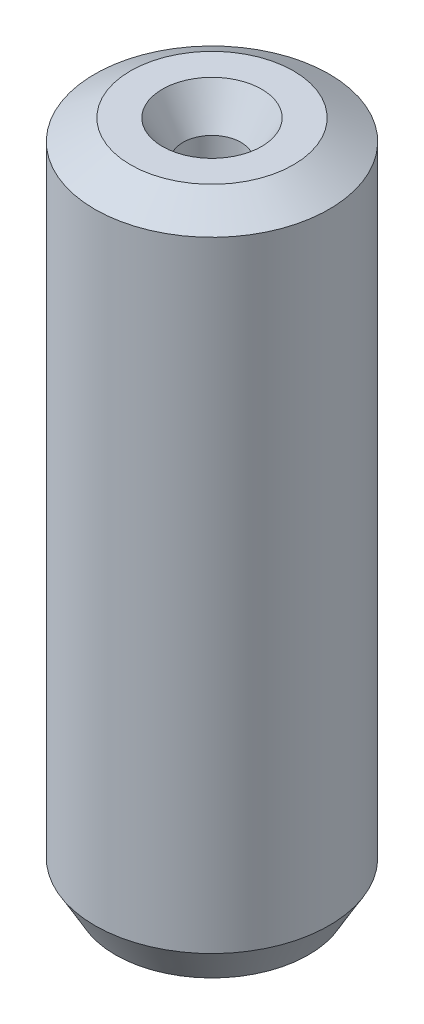
ISO-10303-21;
HEADER;
FILE_DESCRIPTION(('STEP AP214'),'2;1');
FILE_NAME('part.step','',(''),(''),'','','');
FILE_SCHEMA(('AUTOMOTIVE_DESIGN { 1 0 10303 214 1 1 1 1 }'));
ENDSEC;
DATA;
#1=APPLICATION_CONTEXT('core data for automotive mechanical design processes');
#2=APPLICATION_PROTOCOL_DEFINITION('international standard','automotive_design',2000,#1);
#3=PRODUCT_CONTEXT('',#1,'mechanical');
#4=PRODUCT('Part','Part','',(#3));
#5=PRODUCT_RELATED_PRODUCT_CATEGORY('part','',(#4));
#6=PRODUCT_DEFINITION_FORMATION('','',#4);
#7=PRODUCT_DEFINITION_CONTEXT('part definition',#1,'design');
#8=PRODUCT_DEFINITION('design','',#6,#7);
#9=PRODUCT_DEFINITION_SHAPE('','',#8);
#10=(LENGTH_UNIT() NAMED_UNIT(*) SI_UNIT(.MILLI.,.METRE.));
#11=(NAMED_UNIT(*) PLANE_ANGLE_UNIT() SI_UNIT($,.RADIAN.));
#12=(NAMED_UNIT(*) SI_UNIT($,.STERADIAN.) SOLID_ANGLE_UNIT());
#13=UNCERTAINTY_MEASURE_WITH_UNIT(LENGTH_MEASURE(1.E-05),#10,'distance_accuracy_value','');
#14=(GEOMETRIC_REPRESENTATION_CONTEXT(3) GLOBAL_UNCERTAINTY_ASSIGNED_CONTEXT((#13)) GLOBAL_UNIT_ASSIGNED_CONTEXT((#10,
#11,#12)) REPRESENTATION_CONTEXT('',''));
#15=CARTESIAN_POINT('',(0.,0.,0.));
#16=DIRECTION('',(0.,0.,1.));
#17=DIRECTION('',(1.,0.,0.));
#18=AXIS2_PLACEMENT_3D('',#15,#16,#17);
#19=CARTESIAN_POINT('',(0.,28.8736243650082,0.));
#20=DIRECTION('',(0.,-1.,0.));
#21=DIRECTION('',(0.,0.,-1.));
#22=AXIS2_PLACEMENT_3D('',#19,#20,#21);
#23=CYLINDRICAL_SURFACE('',#22,5.);
#24=CARTESIAN_POINT('',(0.,1.52475165972592,0.));
#25=DIRECTION('',(0.,1.,0.));
#26=DIRECTION('',(0.,0.,1.));
#27=AXIS2_PLACEMENT_3D('',#24,#25,#26);
#28=CIRCLE('',#27,5.);
#29=CARTESIAN_POINT('',(0.,1.52475165972592,-5.));
#30=VERTEX_POINT('',#29);
#31=EDGE_CURVE('E10',#30,#30,#28,.T.);
#32=CARTESIAN_POINT('',(0.,27.9933085838182,0.));
#33=DIRECTION('',(0.,1.,0.));
#34=DIRECTION('',(0.,0.,1.));
#35=AXIS2_PLACEMENT_3D('',#32,#33,#34);
#36=CIRCLE('',#35,5.);
#37=CARTESIAN_POINT('',(0.,27.9933085838182,-5.));
#38=VERTEX_POINT('',#37);
#39=EDGE_CURVE('E50',#38,#38,#36,.F.);
#40=CARTESIAN_POINT('',(0.,1.52475165972592,-5.));
#41=CARTESIAN_POINT('',(0.,1.80046579435188,-5.));
#42=CARTESIAN_POINT('',(0.,2.07617992897784,-5.));
#43=CARTESIAN_POINT('',(0.,2.62760819822976,-5.));
#44=CARTESIAN_POINT('',(0.,2.90332233285572,-5.));
#45=CARTESIAN_POINT('',(0.,3.45475060210765,-5.));
#46=CARTESIAN_POINT('',(0.,3.73046473673361,-5.));
#47=CARTESIAN_POINT('',(0.,4.28189300598553,-5.));
#48=CARTESIAN_POINT('',(0.,4.55760714061149,-5.));
#49=CARTESIAN_POINT('',(0.,5.10903540986341,-5.));
#50=CARTESIAN_POINT('',(0.,5.38474954448937,-5.));
#51=CARTESIAN_POINT('',(0.,5.93617781374129,-5.));
#52=CARTESIAN_POINT('',(0.,6.21189194836726,-5.));
#53=CARTESIAN_POINT('',(0.,6.76332021761918,-5.));
#54=CARTESIAN_POINT('',(0.,7.03903435224514,-5.));
#55=CARTESIAN_POINT('',(0.,7.59046262149706,-5.));
#56=CARTESIAN_POINT('',(0.,7.86617675612302,-5.));
#57=CARTESIAN_POINT('',(0.,8.41760502537494,-5.));
#58=CARTESIAN_POINT('',(0.,8.6933191600009,-5.));
#59=CARTESIAN_POINT('',(0.,9.24474742925283,-5.));
#60=CARTESIAN_POINT('',(0.,9.52046156387879,-5.));
#61=CARTESIAN_POINT('',(0.,10.0718898331307,-5.));
#62=CARTESIAN_POINT('',(0.,10.3476039677567,-5.));
#63=CARTESIAN_POINT('',(0.,10.8990322370086,-5.));
#64=CARTESIAN_POINT('',(0.,11.1747463716346,-5.));
#65=CARTESIAN_POINT('',(0.,11.7261746408865,-5.));
#66=CARTESIAN_POINT('',(0.,12.0018887755124,-5.));
#67=CARTESIAN_POINT('',(0.,12.5533170447644,-5.));
#68=CARTESIAN_POINT('',(0.,12.8290311793903,-5.));
#69=CARTESIAN_POINT('',(0.,13.3804594486422,-5.));
#70=CARTESIAN_POINT('',(0.,13.6561735832682,-5.));
#71=CARTESIAN_POINT('',(0.,14.2076018525201,-5.));
#72=CARTESIAN_POINT('',(0.,14.4833159871461,-5.));
#73=CARTESIAN_POINT('',(0.,15.034744256398,-5.));
#74=CARTESIAN_POINT('',(0.,15.310458391024,-5.));
#75=CARTESIAN_POINT('',(0.,15.8618866602759,-5.));
#76=CARTESIAN_POINT('',(0.,16.1376007949019,-5.));
#77=CARTESIAN_POINT('',(0.,16.6890290641538,-5.));
#78=CARTESIAN_POINT('',(0.,16.9647431987797,-5.));
#79=CARTESIAN_POINT('',(0.,17.5161714680317,-5.));
#80=CARTESIAN_POINT('',(0.,17.7918856026576,-5.));
#81=CARTESIAN_POINT('',(0.,18.3433138719095,-5.));
#82=CARTESIAN_POINT('',(0.,18.6190280065355,-5.));
#83=CARTESIAN_POINT('',(0.,19.1704562757874,-5.));
#84=CARTESIAN_POINT('',(0.,19.4461704104134,-5.));
#85=CARTESIAN_POINT('',(0.,19.9975986796653,-5.));
#86=CARTESIAN_POINT('',(0.,20.2733128142913,-5.));
#87=CARTESIAN_POINT('',(0.,20.8247410835432,-5.));
#88=CARTESIAN_POINT('',(0.,21.1004552181692,-5.));
#89=CARTESIAN_POINT('',(0.,21.6518834874211,-5.));
#90=CARTESIAN_POINT('',(0.,21.927597622047,-5.));
#91=CARTESIAN_POINT('',(0.,22.479025891299,-5.));
#92=CARTESIAN_POINT('',(0.,22.7547400259249,-5.));
#93=CARTESIAN_POINT('',(0.,23.3061682951768,-5.));
#94=CARTESIAN_POINT('',(0.,23.5818824298028,-5.));
#95=CARTESIAN_POINT('',(0.,24.1333106990547,-5.));
#96=CARTESIAN_POINT('',(0.,24.4090248336807,-5.));
#97=CARTESIAN_POINT('',(0.,24.9604531029326,-5.));
#98=CARTESIAN_POINT('',(0.,25.2361672375586,-5.));
#99=CARTESIAN_POINT('',(0.,25.7875955068105,-5.));
#100=CARTESIAN_POINT('',(0.,26.0633096414365,-5.));
#101=CARTESIAN_POINT('',(0.,26.6147379106884,-5.));
#102=CARTESIAN_POINT('',(0.,26.8904520453143,-5.));
#103=CARTESIAN_POINT('',(0.,27.4418803145663,-5.));
#104=CARTESIAN_POINT('',(0.,27.7175944491922,-5.));
#105=CARTESIAN_POINT('',(0.,27.9933085838182,-5.));
#106=B_SPLINE_CURVE_WITH_KNOTS('',3,(#40,#41,#42,#43,#44,#45,#46,#47,#48,#49,#50,#51,#52,#53,
#54,#55,#56,#57,#58,#59,#60,#61,#62,#63,#64,#65,#66,#67,#68,#69,#70,#71,#72,#73,#74,#75,#76,#77,
#78,#79,#80,#81,#82,#83,#84,#85,#86,#87,#88,#89,#90,#91,#92,#93,#94,#95,#96,#97,#98,#99,#100,
#101,#102,#103,#104,#105),.UNSPECIFIED.,.F.,.F.,(4,2,2,2,2,2,2,2,2,2,2,2,2,2,2,2,2,2,2,2,2,2,2,
2,2,2,2,2,2,2,2,2,4),(0.,0.827142403877882,1.65428480775577,2.48142721163365,3.30856961551153,
4.13571201938942,4.9628544232673,5.78999682714518,6.61713923102307,7.44428163490095,
8.27142403877883,9.09856644265672,9.9257088465346,10.7528512504125,11.5799936542904,
12.4071360581682,13.2342784620461,14.061420865924,14.8885632698019,15.7157056736798,
16.5428480775577,17.3699904814355,18.1971328853134,19.0242752891913,19.8514176930692,
20.6785600969471,21.505702500825,22.3328449047028,23.1599873085807,23.9871297124586,
24.8142721163365,25.6414145202144,26.4685569240923),.UNSPECIFIED.);
#107=EDGE_CURVE('BSEAM39',#30,#38,#106,.T.);
#108=ORIENTED_EDGE('',*,*,#31,.T.);
#109=ORIENTED_EDGE('',*,*,#39,.T.);
#110=ORIENTED_EDGE('',*,*,#107,.T.);
#111=ORIENTED_EDGE('',*,*,#107,.F.);
#112=EDGE_LOOP('',(#108,#110,#109,#111));
#113=FACE_BOUND('',#112,.T.);
#114=ADVANCED_FACE('F39',(#113),#23,.T.);
#115=CARTESIAN_POINT('',(0.,28.8736243650082,0.));
#116=DIRECTION('',(0.,1.,0.));
#117=DIRECTION('',(0.,0.,1.));
#118=AXIS2_PLACEMENT_3D('',#115,#116,#117);
#119=PLANE('',#118);
#120=CARTESIAN_POINT('',(0.,28.8736243650082,0.));
#121=DIRECTION('',(0.,1.,0.));
#122=DIRECTION('',(0.,0.,1.));
#123=AXIS2_PLACEMENT_3D('',#120,#121,#122);
#124=CIRCLE('',#123,2.11850116200963);
#125=CARTESIAN_POINT('',(0.,28.8736243650082,2.11850116200963));
#126=VERTEX_POINT('',#125);
#127=EDGE_CURVE('E58',#126,#126,#124,.F.);
#128=ORIENTED_EDGE('',*,*,#127,.T.);
#129=EDGE_LOOP('',(#128));
#130=FACE_BOUND('',#129,.T.);
#131=CARTESIAN_POINT('',(0.,28.8736243650082,0.));
#132=DIRECTION('',(0.,1.,0.));
#133=DIRECTION('',(0.,0.,1.));
#134=AXIS2_PLACEMENT_3D('',#131,#132,#133);
#135=CIRCLE('',#134,3.47524834027414);
#136=CARTESIAN_POINT('',(0.,28.8736243650082,-3.47524834027414));
#137=VERTEX_POINT('',#136);
#138=EDGE_CURVE('E61',#137,#137,#135,.T.);
#139=ORIENTED_EDGE('',*,*,#138,.T.);
#140=EDGE_LOOP('',(#139));
#141=FACE_BOUND('',#140,.T.);
#142=ADVANCED_FACE('F88',(#130,#141),#119,.T.);
#143=CARTESIAN_POINT('',(0.,0.,0.));
#144=DIRECTION('',(0.,1.,0.));
#145=DIRECTION('',(0.,0.,1.));
#146=AXIS2_PLACEMENT_3D('',#143,#144,#145);
#147=PLANE('',#146);
#148=CARTESIAN_POINT('',(0.,0.,0.));
#149=DIRECTION('',(0.,1.,0.));
#150=DIRECTION('',(0.,0.,1.));
#151=AXIS2_PLACEMENT_3D('',#148,#149,#150);
#152=CIRCLE('',#151,2.7629370405454);
#153=CARTESIAN_POINT('',(0.,0.,2.7629370405454));
#154=VERTEX_POINT('',#153);
#155=EDGE_CURVE('E51',#154,#154,#152,.T.);
#156=ORIENTED_EDGE('',*,*,#155,.T.);
#157=EDGE_LOOP('',(#156));
#158=FACE_BOUND('',#157,.T.);
#159=CARTESIAN_POINT('',(0.,0.,0.));
#160=DIRECTION('',(0.,1.,0.));
#161=DIRECTION('',(0.,0.,1.));
#162=AXIS2_PLACEMENT_3D('',#159,#160,#161);
#163=CIRCLE('',#162,4.1196842188099);
#164=CARTESIAN_POINT('',(0.,0.,4.1196842188099));
#165=VERTEX_POINT('',#164);
#166=EDGE_CURVE('E54',#165,#165,#163,.F.);
#167=ORIENTED_EDGE('',*,*,#166,.T.);
#168=EDGE_LOOP('',(#167));
#169=FACE_BOUND('',#168,.T.);
#170=ADVANCED_FACE('F83',(#158,#169),#147,.F.);
#171=CARTESIAN_POINT('',(0.,28.8736243650082,0.));
#172=DIRECTION('',(0.,-1.,0.));
#173=DIRECTION('',(0.,0.,-1.));
#174=AXIS2_PLACEMENT_3D('',#171,#172,#173);
#175=CYLINDRICAL_SURFACE('',#174,1.23818538081955);
#176=CARTESIAN_POINT('',(0.,27.3488727052823,0.));
#177=DIRECTION('',(0.,1.,0.));
#178=DIRECTION('',(0.,0.,1.));
#179=AXIS2_PLACEMENT_3D('',#176,#177,#178);
#180=CIRCLE('',#179,1.23818538081955);
#181=CARTESIAN_POINT('',(0.,27.3488727052823,-1.23818538081955));
#182=VERTEX_POINT('',#181);
#183=EDGE_CURVE('E67',#182,#182,#180,.T.);
#184=CARTESIAN_POINT('',(0.,0.880315781190067,0.));
#185=DIRECTION('',(0.,1.,0.));
#186=DIRECTION('',(0.,0.,1.));
#187=AXIS2_PLACEMENT_3D('',#184,#185,#186);
#188=CIRCLE('',#187,1.23818538081955);
#189=CARTESIAN_POINT('',(0.,0.880315781190064,-1.23818538081955));
#190=VERTEX_POINT('',#189);
#191=EDGE_CURVE('E69',#190,#190,#188,.F.);
#192=CARTESIAN_POINT('',(0.,27.3488727052823,-1.23818538081955));
#193=CARTESIAN_POINT('',(0.,27.0731585706564,-1.23818538081955));
#194=CARTESIAN_POINT('',(0.,26.7974444360304,-1.23818538081955));
#195=CARTESIAN_POINT('',(0.,26.2460161667785,-1.23818538081955));
#196=CARTESIAN_POINT('',(0.,25.9703020321525,-1.23818538081955));
#197=CARTESIAN_POINT('',(0.,25.4188737629006,-1.23818538081955));
#198=CARTESIAN_POINT('',(0.,25.1431596282746,-1.23818538081955));
#199=CARTESIAN_POINT('',(0.,24.5917313590227,-1.23818538081955));
#200=CARTESIAN_POINT('',(0.,24.3160172243968,-1.23818538081955));
#201=CARTESIAN_POINT('',(0.,23.7645889551448,-1.23818538081955));
#202=CARTESIAN_POINT('',(0.,23.4888748205189,-1.23818538081955));
#203=CARTESIAN_POINT('',(0.,22.937446551267,-1.23818538081955));
#204=CARTESIAN_POINT('',(0.,22.661732416641,-1.23818538081955));
#205=CARTESIAN_POINT('',(0.,22.1103041473891,-1.23818538081955));
#206=CARTESIAN_POINT('',(0.,21.8345900127631,-1.23818538081955));
#207=CARTESIAN_POINT('',(0.,21.2831617435112,-1.23818538081955));
#208=CARTESIAN_POINT('',(0.,21.0074476088852,-1.23818538081955));
#209=CARTESIAN_POINT('',(0.,20.4560193396333,-1.23818538081955));
#210=CARTESIAN_POINT('',(0.,20.1803052050073,-1.23818538081955));
#211=CARTESIAN_POINT('',(0.,19.6288769357554,-1.23818538081955));
#212=CARTESIAN_POINT('',(0.,19.3531628011295,-1.23818538081955));
#213=CARTESIAN_POINT('',(0.,18.8017345318775,-1.23818538081955));
#214=CARTESIAN_POINT('',(0.,18.5260203972516,-1.23818538081955));
#215=CARTESIAN_POINT('',(0.,17.9745921279997,-1.23818538081955));
#216=CARTESIAN_POINT('',(0.,17.6988779933737,-1.23818538081955));
#217=CARTESIAN_POINT('',(0.,17.1474497241218,-1.23818538081955));
#218=CARTESIAN_POINT('',(0.,16.8717355894958,-1.23818538081955));
#219=CARTESIAN_POINT('',(0.,16.3203073202439,-1.23818538081955));
#220=CARTESIAN_POINT('',(0.,16.0445931856179,-1.23818538081955));
#221=CARTESIAN_POINT('',(0.,15.493164916366,-1.23818538081955));
#222=CARTESIAN_POINT('',(0.,15.21745078174,-1.23818538081955));
#223=CARTESIAN_POINT('',(0.,14.6660225124881,-1.23818538081955));
#224=CARTESIAN_POINT('',(0.,14.3903083778622,-1.23818538081955));
#225=CARTESIAN_POINT('',(0.,13.8388801086102,-1.23818538081955));
#226=CARTESIAN_POINT('',(0.,13.5631659739843,-1.23818538081955));
#227=CARTESIAN_POINT('',(0.,13.0117377047324,-1.23818538081955));
#228=CARTESIAN_POINT('',(0.,12.7360235701064,-1.23818538081955));
#229=CARTESIAN_POINT('',(0.,12.1845953008545,-1.23818538081955));
#230=CARTESIAN_POINT('',(0.,11.9088811662285,-1.23818538081955));
#231=CARTESIAN_POINT('',(0.,11.3574528969766,-1.23818538081955));
#232=CARTESIAN_POINT('',(0.,11.0817387623506,-1.23818538081955));
#233=CARTESIAN_POINT('',(0.,10.5303104930987,-1.23818538081955));
#234=CARTESIAN_POINT('',(0.,10.2545963584727,-1.23818538081955));
#235=CARTESIAN_POINT('',(0.,9.70316808922082,-1.23818538081955));
#236=CARTESIAN_POINT('',(0.,9.42745395459486,-1.23818538081955));
#237=CARTESIAN_POINT('',(0.,8.87602568534294,-1.23818538081955));
#238=CARTESIAN_POINT('',(0.,8.60031155071698,-1.23818538081955));
#239=CARTESIAN_POINT('',(0.,8.04888328146505,-1.23818538081955));
#240=CARTESIAN_POINT('',(0.,7.77316914683909,-1.23818538081955));
#241=CARTESIAN_POINT('',(0.,7.22174087758717,-1.23818538081955));
#242=CARTESIAN_POINT('',(0.,6.94602674296121,-1.23818538081955));
#243=CARTESIAN_POINT('',(0.,6.39459847370929,-1.23818538081955));
#244=CARTESIAN_POINT('',(0.,6.11888433908333,-1.23818538081955));
#245=CARTESIAN_POINT('',(0.,5.5674560698314,-1.23818538081955));
#246=CARTESIAN_POINT('',(0.,5.29174193520544,-1.23818538081955));
#247=CARTESIAN_POINT('',(0.,4.74031366595352,-1.23818538081955));
#248=CARTESIAN_POINT('',(0.,4.46459953132756,-1.23818538081955));
#249=CARTESIAN_POINT('',(0.,3.91317126207564,-1.23818538081955));
#250=CARTESIAN_POINT('',(0.,3.63745712744967,-1.23818538081955));
#251=CARTESIAN_POINT('',(0.,3.08602885819775,-1.23818538081955));
#252=CARTESIAN_POINT('',(0.,2.81031472357179,-1.23818538081955));
#253=CARTESIAN_POINT('',(0.,2.25888645431987,-1.23818538081955));
#254=CARTESIAN_POINT('',(0.,1.98317231969391,-1.23818538081955));
#255=CARTESIAN_POINT('',(0.,1.43174405044198,-1.23818538081955));
#256=CARTESIAN_POINT('',(0.,1.15602991581602,-1.23818538081955));
#257=CARTESIAN_POINT('',(0.,0.880315781190064,-1.23818538081955));
#258=B_SPLINE_CURVE_WITH_KNOTS('',3,(#192,#193,#194,#195,#196,#197,#198,#199,#200,#201,#202,
#203,#204,#205,#206,#207,#208,#209,#210,#211,#212,#213,#214,#215,#216,#217,#218,#219,#220,#221,
#222,#223,#224,#225,#226,#227,#228,#229,#230,#231,#232,#233,#234,#235,#236,#237,#238,#239,#240,
#241,#242,#243,#244,#245,#246,#247,#248,#249,#250,#251,#252,#253,#254,#255,#256,#257),
.UNSPECIFIED.,.F.,.F.,(4,2,2,2,2,2,2,2,2,2,2,2,2,2,2,2,2,2,2,2,2,2,2,2,2,2,2,2,2,2,2,2,4),(0.,
0.827142403877882,1.65428480775576,2.48142721163365,3.30856961551153,4.13571201938942,
4.9628544232673,5.78999682714518,6.61713923102307,7.44428163490095,8.27142403877883,
9.09856644265672,9.9257088465346,10.7528512504125,11.5799936542904,12.4071360581682,
13.2342784620461,14.061420865924,14.8885632698019,15.7157056736798,16.5428480775577,
17.3699904814356,18.1971328853134,19.0242752891913,19.8514176930692,20.6785600969471,
21.505702500825,22.3328449047029,23.1599873085807,23.9871297124586,24.8142721163365,
25.6414145202144,26.4685569240923),.UNSPECIFIED.);
#259=EDGE_CURVE('BSEAM71',#182,#190,#258,.T.);
#260=ORIENTED_EDGE('',*,*,#183,.T.);
#261=ORIENTED_EDGE('',*,*,#191,.T.);
#262=ORIENTED_EDGE('',*,*,#259,.T.);
#263=ORIENTED_EDGE('',*,*,#259,.F.);
#264=EDGE_LOOP('',(#260,#262,#261,#263));
#265=FACE_BOUND('',#264,.T.);
#266=ADVANCED_FACE('F71',(#265),#175,.F.);
#267=CARTESIAN_POINT('',(0.,27.3488727052823,0.));
#268=DIRECTION('',(0.,1.,0.));
#269=DIRECTION('',(0.,0.,1.));
#270=AXIS2_PLACEMENT_3D('',#267,#268,#269);
#271=CONICAL_SURFACE('',#270,1.23818538081955,0.523598775598301);
#272=ORIENTED_EDGE('',*,*,#127,.F.);
#273=EDGE_LOOP('',(#272));
#274=FACE_BOUND('',#273,.T.);
#275=ORIENTED_EDGE('',*,*,#183,.F.);
#276=EDGE_LOOP('',(#275));
#277=FACE_BOUND('',#276,.T.);
#278=ADVANCED_FACE('F77',(#274,#277),#271,.F.);
#279=CARTESIAN_POINT('',(0.,0.,0.));
#280=DIRECTION('',(0.,-1.,0.));
#281=DIRECTION('',(0.,0.,-1.));
#282=AXIS2_PLACEMENT_3D('',#279,#280,#281);
#283=CONICAL_SURFACE('',#282,2.7629370405454,1.04719755119659);
#284=ORIENTED_EDGE('',*,*,#191,.F.);
#285=EDGE_LOOP('',(#284));
#286=FACE_BOUND('',#285,.T.);
#287=ORIENTED_EDGE('',*,*,#155,.F.);
#288=EDGE_LOOP('',(#287));
#289=FACE_BOUND('',#288,.T.);
#290=ADVANCED_FACE('F73',(#286,#289),#283,.F.);
#291=CARTESIAN_POINT('',(0.,1.52475165972592,0.));
#292=DIRECTION('',(0.,1.,0.));
#293=DIRECTION('',(0.,0.,1.));
#294=AXIS2_PLACEMENT_3D('',#291,#292,#293);
#295=CONICAL_SURFACE('',#294,5.,0.523598775598303);
#296=ORIENTED_EDGE('',*,*,#166,.F.);
#297=EDGE_LOOP('',(#296));
#298=FACE_BOUND('',#297,.T.);
#299=ORIENTED_EDGE('',*,*,#31,.F.);
#300=EDGE_LOOP('',(#299));
#301=FACE_BOUND('',#300,.T.);
#302=ADVANCED_FACE('F76',(#298,#301),#295,.T.);
#303=CARTESIAN_POINT('',(0.,28.8736243650082,0.));
#304=DIRECTION('',(0.,-1.,0.));
#305=DIRECTION('',(0.,0.,-1.));
#306=AXIS2_PLACEMENT_3D('',#303,#304,#305);
#307=CONICAL_SURFACE('',#306,3.47524834027414,1.04719755119659);
#308=CARTESIAN_POINT('',(0.,27.9933085838182,-5.));
#309=CARTESIAN_POINT('',(0.,28.0024785398722,-4.98411717021119));
#310=CARTESIAN_POINT('',(0.,28.0116484959263,-4.96823434042238));
#311=CARTESIAN_POINT('',(0.,28.0299884080344,-4.93646868084476));
#312=CARTESIAN_POINT('',(0.,28.0391583640885,-4.92058585105595));
#313=CARTESIAN_POINT('',(0.,28.0574982761966,-4.88882019147833));
#314=CARTESIAN_POINT('',(0.,28.0666682322507,-4.87293736168951));
#315=CARTESIAN_POINT('',(0.,28.0850081443588,-4.84117170211189));
#316=CARTESIAN_POINT('',(0.,28.0941781004129,-4.82528887232308));
#317=CARTESIAN_POINT('',(0.,28.112518012521,-4.79352321274546));
#318=CARTESIAN_POINT('',(0.,28.1216879685751,-4.77764038295665));
#319=CARTESIAN_POINT('',(0.,28.1400278806832,-4.74587472337903));
#320=CARTESIAN_POINT('',(0.,28.1491978367373,-4.72999189359022));
#321=CARTESIAN_POINT('',(0.,28.1675377488454,-4.69822623401259));
#322=CARTESIAN_POINT('',(0.,28.1767077048994,-4.68234340422378));
#323=CARTESIAN_POINT('',(0.,28.1950476170076,-4.65057774464616));
#324=CARTESIAN_POINT('',(0.,28.2042175730616,-4.63469491485735));
#325=CARTESIAN_POINT('',(0.,28.2225574851698,-4.60292925527973));
#326=CARTESIAN_POINT('',(0.,28.2317274412238,-4.58704642549092));
#327=CARTESIAN_POINT('',(0.,28.2500673533319,-4.55528076591329));
#328=CARTESIAN_POINT('',(0.,28.259237309386,-4.53939793612448));
#329=CARTESIAN_POINT('',(0.,28.2775772214941,-4.50763227654686));
#330=CARTESIAN_POINT('',(0.,28.2867471775482,-4.49174944675805));
#331=CARTESIAN_POINT('',(0.,28.3050870896563,-4.45998378718043));
#332=CARTESIAN_POINT('',(0.,28.3142570457104,-4.44410095739162));
#333=CARTESIAN_POINT('',(0.,28.3325969578185,-4.41233529781399));
#334=CARTESIAN_POINT('',(0.,28.3417669138726,-4.39645246802518));
#335=CARTESIAN_POINT('',(0.,28.3601068259807,-4.36468680844756));
#336=CARTESIAN_POINT('',(0.,28.3692767820348,-4.34880397865875));
#337=CARTESIAN_POINT('',(0.,28.3876166941429,-4.31703831908113));
#338=CARTESIAN_POINT('',(0.,28.396786650197,-4.30115548929232));
#339=CARTESIAN_POINT('',(0.,28.4151265623051,-4.26938982971469));
#340=CARTESIAN_POINT('',(0.,28.4242965183591,-4.25350699992588));
#341=CARTESIAN_POINT('',(0.,28.4426364304673,-4.22174134034826));
#342=CARTESIAN_POINT('',(0.,28.4518063865213,-4.20585851055945));
#343=CARTESIAN_POINT('',(0.,28.4701462986295,-4.17409285098183));
#344=CARTESIAN_POINT('',(0.,28.4793162546835,-4.15821002119302));
#345=CARTESIAN_POINT('',(0.,28.4976561667916,-4.12644436161539));
#346=CARTESIAN_POINT('',(0.,28.5068261228457,-4.11056153182658));
#347=CARTESIAN_POINT('',(0.,28.5251660349538,-4.07879587224896));
#348=CARTESIAN_POINT('',(0.,28.5343359910079,-4.06291304246015));
#349=CARTESIAN_POINT('',(0.,28.552675903116,-4.03114738288253));
#350=CARTESIAN_POINT('',(0.,28.5618458591701,-4.01526455309372));
#351=CARTESIAN_POINT('',(0.,28.5801857712782,-3.9834988935161));
#352=CARTESIAN_POINT('',(0.,28.5893557273323,-3.96761606372728));
#353=CARTESIAN_POINT('',(0.,28.6076956394404,-3.93585040414966));
#354=CARTESIAN_POINT('',(0.,28.6168655954945,-3.91996757436085));
#355=CARTESIAN_POINT('',(0.,28.6352055076026,-3.88820191478323));
#356=CARTESIAN_POINT('',(0.,28.6443754636567,-3.87231908499442));
#357=CARTESIAN_POINT('',(0.,28.6627153757648,-3.8405534254168));
#358=CARTESIAN_POINT('',(0.,28.6718853318189,-3.82467059562798));
#359=CARTESIAN_POINT('',(0.,28.690225243927,-3.79290493605036));
#360=CARTESIAN_POINT('',(0.,28.699395199981,-3.77702210626155));
#361=CARTESIAN_POINT('',(0.,28.7177351120892,-3.74525644668393));
#362=CARTESIAN_POINT('',(0.,28.7269050681432,-3.72937361689512));
#363=CARTESIAN_POINT('',(0.,28.7452449802514,-3.6976079573175));
#364=CARTESIAN_POINT('',(0.,28.7544149363054,-3.68172512752869));
#365=CARTESIAN_POINT('',(0.,28.7727548484135,-3.64995946795106));
#366=CARTESIAN_POINT('',(0.,28.7819248044676,-3.63407663816225));
#367=CARTESIAN_POINT('',(0.,28.8002647165757,-3.60231097858463));
#368=CARTESIAN_POINT('',(0.,28.8094346726298,-3.58642814879582));
#369=CARTESIAN_POINT('',(0.,28.8277745847379,-3.5546624892182));
#370=CARTESIAN_POINT('',(0.,28.836944540792,-3.53877965942939));
#371=CARTESIAN_POINT('',(0.,28.8552844529001,-3.50701399985176));
#372=CARTESIAN_POINT('',(0.,28.8644544089542,-3.49113117006295));
#373=CARTESIAN_POINT('',(0.,28.8736243650082,-3.47524834027414));
#374=B_SPLINE_CURVE_WITH_KNOTS('',3,(#308,#309,#310,#311,#312,#313,#314,#315,#316,#317,#318,
#319,#320,#321,#322,#323,#324,#325,#326,#327,#328,#329,#330,#331,#332,#333,#334,#335,#336,#337,
#338,#339,#340,#341,#342,#343,#344,#345,#346,#347,#348,#349,#350,#351,#352,#353,#354,#355,#356,
#357,#358,#359,#360,#361,#362,#363,#364,#365,#366,#367,#368,#369,#370,#371,#372,#373),
.UNSPECIFIED.,.F.,.F.,(4,2,2,2,2,2,2,2,2,2,2,2,2,2,2,2,2,2,2,2,2,2,2,2,2,2,2,2,2,2,2,2,4),(0.,
0.0550197363243767,0.110039472648756,0.165059208973134,0.220078945297513,0.275098681621892,
0.33011841794627,0.385138154270649,0.440157890595029,0.495177626919405,0.550197363243784,
0.605217099568163,0.660236835892541,0.715256572216921,0.770276308541299,0.825296044865678,
0.880315781190057,0.935335517514434,0.990355253838812,1.04537499016319,1.10039472648757,
1.15541446281195,1.21043419913633,1.26545393546071,1.32047367178508,1.37549340810946,
1.43051314443384,1.48553288075822,1.5405526170826,1.59557235340698,1.65059208973136,
1.70561182605573,1.76063156238011),.UNSPECIFIED.);
#375=EDGE_CURVE('BSEAM45',#38,#137,#374,.T.);
#376=ORIENTED_EDGE('',*,*,#39,.F.);
#377=ORIENTED_EDGE('',*,*,#138,.F.);
#378=ORIENTED_EDGE('',*,*,#375,.T.);
#379=ORIENTED_EDGE('',*,*,#375,.F.);
#380=EDGE_LOOP('',(#376,#378,#377,#379));
#381=FACE_BOUND('',#380,.T.);
#382=ADVANCED_FACE('F45',(#381),#307,.T.);
#383=CLOSED_SHELL('',(#114,#142,#170,#266,#278,#290,#302,#382));
#384=MANIFOLD_SOLID_BREP('B2',#383);
#385=ADVANCED_BREP_SHAPE_REPRESENTATION('',(#18,#384),#14);
#386=SHAPE_DEFINITION_REPRESENTATION(#9,#385);
ENDSEC;
END-ISO-10303-21;
